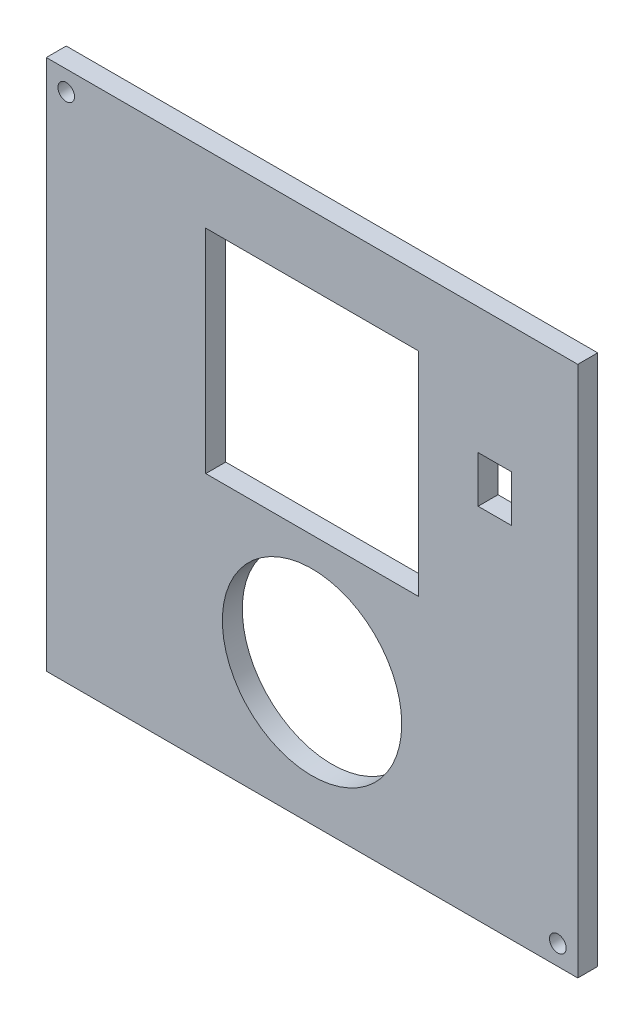
ISO-10303-21;
HEADER;
FILE_DESCRIPTION(('STEP AP214'),'2;1');
FILE_NAME('part.step','',(''),(''),'','','');
FILE_SCHEMA(('AUTOMOTIVE_DESIGN { 1 0 10303 214 1 1 1 1 }'));
ENDSEC;
DATA;
#1=APPLICATION_CONTEXT('core data for automotive mechanical design processes');
#2=APPLICATION_PROTOCOL_DEFINITION('international standard','automotive_design',2000,#1);
#3=PRODUCT_CONTEXT('',#1,'mechanical');
#4=PRODUCT('Part','Part','',(#3));
#5=PRODUCT_RELATED_PRODUCT_CATEGORY('part','',(#4));
#6=PRODUCT_DEFINITION_FORMATION('','',#4);
#7=PRODUCT_DEFINITION_CONTEXT('part definition',#1,'design');
#8=PRODUCT_DEFINITION('design','',#6,#7);
#9=PRODUCT_DEFINITION_SHAPE('','',#8);
#10=(LENGTH_UNIT() NAMED_UNIT(*) SI_UNIT(.MILLI.,.METRE.));
#11=(NAMED_UNIT(*) PLANE_ANGLE_UNIT() SI_UNIT($,.RADIAN.));
#12=(NAMED_UNIT(*) SI_UNIT($,.STERADIAN.) SOLID_ANGLE_UNIT());
#13=UNCERTAINTY_MEASURE_WITH_UNIT(LENGTH_MEASURE(1.E-05),#10,'distance_accuracy_value','');
#14=(GEOMETRIC_REPRESENTATION_CONTEXT(3) GLOBAL_UNCERTAINTY_ASSIGNED_CONTEXT((#13)) GLOBAL_UNIT_ASSIGNED_CONTEXT((#10,
#11,#12)) REPRESENTATION_CONTEXT('',''));
#15=CARTESIAN_POINT('',(0.,0.,0.));
#16=DIRECTION('',(0.,0.,1.));
#17=DIRECTION('',(1.,0.,0.));
#18=AXIS2_PLACEMENT_3D('',#15,#16,#17);
#19=CARTESIAN_POINT('',(0.,0.,3.));
#20=DIRECTION('',(1.,0.,0.));
#21=DIRECTION('',(0.,0.,-1.));
#22=AXIS2_PLACEMENT_3D('',#19,#20,#21);
#23=PLANE('',#22);
#24=DIRECTION('',(0.,-1.,0.));
#25=VECTOR('',#24,1.);
#26=CARTESIAN_POINT('',(0.,0.,0.));
#27=LINE('',#26,#25);
#28=CARTESIAN_POINT('',(0.,80.,0.));
#29=VERTEX_POINT('',#28);
#30=CARTESIAN_POINT('',(0.,0.,0.));
#31=VERTEX_POINT('',#30);
#32=EDGE_CURVE('E227',#29,#31,#27,.T.);
#33=ORIENTED_EDGE('',*,*,#32,.T.);
#34=DIRECTION('',(0.,0.,-1.));
#35=VECTOR('',#34,1.);
#36=CARTESIAN_POINT('',(0.,0.,3.));
#37=LINE('',#36,#35);
#38=CARTESIAN_POINT('',(0.,0.,3.));
#39=VERTEX_POINT('',#38);
#40=EDGE_CURVE('E268',#39,#31,#37,.T.);
#41=ORIENTED_EDGE('',*,*,#40,.F.);
#42=DIRECTION('',(0.,-1.,0.));
#43=VECTOR('',#42,1.);
#44=CARTESIAN_POINT('',(0.,0.,3.));
#45=LINE('',#44,#43);
#46=CARTESIAN_POINT('',(0.,80.,3.));
#47=VERTEX_POINT('',#46);
#48=EDGE_CURVE('E231',#47,#39,#45,.T.);
#49=ORIENTED_EDGE('',*,*,#48,.F.);
#50=DIRECTION('',(0.,0.,-1.));
#51=VECTOR('',#50,1.);
#52=CARTESIAN_POINT('',(0.,80.,3.));
#53=LINE('',#52,#51);
#54=EDGE_CURVE('E245',#47,#29,#53,.T.);
#55=ORIENTED_EDGE('',*,*,#54,.T.);
#56=EDGE_LOOP('',(#33,#41,#49,#55));
#57=FACE_BOUND('',#56,.T.);
#58=ADVANCED_FACE('F38',(#57),#23,.F.);
#59=CARTESIAN_POINT('',(0.,0.,3.));
#60=DIRECTION('',(0.,1.,0.));
#61=DIRECTION('',(0.,0.,1.));
#62=AXIS2_PLACEMENT_3D('',#59,#60,#61);
#63=PLANE('',#62);
#64=DIRECTION('',(1.,0.,0.));
#65=VECTOR('',#64,1.);
#66=CARTESIAN_POINT('',(0.,0.,0.));
#67=LINE('',#66,#65);
#68=CARTESIAN_POINT('',(80.,0.,0.));
#69=VERTEX_POINT('',#68);
#70=EDGE_CURVE('E249',#31,#69,#67,.T.);
#71=ORIENTED_EDGE('',*,*,#70,.T.);
#72=DIRECTION('',(0.,0.,-1.));
#73=VECTOR('',#72,1.);
#74=CARTESIAN_POINT('',(80.,0.,3.));
#75=LINE('',#74,#73);
#76=CARTESIAN_POINT('',(80.,0.,3.));
#77=VERTEX_POINT('',#76);
#78=EDGE_CURVE('E264',#77,#69,#75,.T.);
#79=ORIENTED_EDGE('',*,*,#78,.F.);
#80=DIRECTION('',(1.,0.,0.));
#81=VECTOR('',#80,1.);
#82=CARTESIAN_POINT('',(0.,0.,3.));
#83=LINE('',#82,#81);
#84=EDGE_CURVE('E235',#39,#77,#83,.T.);
#85=ORIENTED_EDGE('',*,*,#84,.F.);
#86=ORIENTED_EDGE('',*,*,#40,.T.);
#87=EDGE_LOOP('',(#71,#79,#85,#86));
#88=FACE_BOUND('',#87,.T.);
#89=ADVANCED_FACE('F298',(#88),#63,.F.);
#90=CARTESIAN_POINT('',(80.,0.,3.));
#91=DIRECTION('',(-1.,0.,0.));
#92=DIRECTION('',(0.,0.,1.));
#93=AXIS2_PLACEMENT_3D('',#90,#91,#92);
#94=PLANE('',#93);
#95=DIRECTION('',(0.,1.,0.));
#96=VECTOR('',#95,1.);
#97=CARTESIAN_POINT('',(80.,0.,0.));
#98=LINE('',#97,#96);
#99=CARTESIAN_POINT('',(80.,80.,0.));
#100=VERTEX_POINT('',#99);
#101=EDGE_CURVE('E252',#69,#100,#98,.T.);
#102=ORIENTED_EDGE('',*,*,#101,.T.);
#103=DIRECTION('',(0.,0.,-1.));
#104=VECTOR('',#103,1.);
#105=CARTESIAN_POINT('',(80.,80.,3.));
#106=LINE('',#105,#104);
#107=CARTESIAN_POINT('',(80.,80.,3.));
#108=VERTEX_POINT('',#107);
#109=EDGE_CURVE('E260',#108,#100,#106,.T.);
#110=ORIENTED_EDGE('',*,*,#109,.F.);
#111=DIRECTION('',(0.,1.,0.));
#112=VECTOR('',#111,1.);
#113=CARTESIAN_POINT('',(80.,0.,3.));
#114=LINE('',#113,#112);
#115=EDGE_CURVE('E239',#77,#108,#114,.T.);
#116=ORIENTED_EDGE('',*,*,#115,.F.);
#117=ORIENTED_EDGE('',*,*,#78,.T.);
#118=EDGE_LOOP('',(#102,#110,#116,#117));
#119=FACE_BOUND('',#118,.T.);
#120=ADVANCED_FACE('F303',(#119),#94,.F.);
#121=CARTESIAN_POINT('',(0.,80.,3.));
#122=DIRECTION('',(0.,-1.,0.));
#123=DIRECTION('',(0.,0.,-1.));
#124=AXIS2_PLACEMENT_3D('',#121,#122,#123);
#125=PLANE('',#124);
#126=DIRECTION('',(-1.,0.,0.));
#127=VECTOR('',#126,1.);
#128=CARTESIAN_POINT('',(0.,80.,0.));
#129=LINE('',#128,#127);
#130=EDGE_CURVE('E236',#100,#29,#129,.T.);
#131=ORIENTED_EDGE('',*,*,#130,.T.);
#132=ORIENTED_EDGE('',*,*,#54,.F.);
#133=DIRECTION('',(-1.,0.,0.));
#134=VECTOR('',#133,1.);
#135=CARTESIAN_POINT('',(0.,80.,3.));
#136=LINE('',#135,#134);
#137=EDGE_CURVE('E242',#108,#47,#136,.T.);
#138=ORIENTED_EDGE('',*,*,#137,.F.);
#139=ORIENTED_EDGE('',*,*,#109,.T.);
#140=EDGE_LOOP('',(#131,#132,#138,#139));
#141=FACE_BOUND('',#140,.T.);
#142=ADVANCED_FACE('F318',(#141),#125,.F.);
#143=CARTESIAN_POINT('',(0.,0.,3.));
#144=DIRECTION('',(0.,0.,-1.));
#145=DIRECTION('',(-1.,0.,0.));
#146=AXIS2_PLACEMENT_3D('',#143,#144,#145);
#147=PLANE('',#146);
#148=DIRECTION('',(-1.,0.,0.));
#149=VECTOR('',#148,1.);
#150=CARTESIAN_POINT('',(65.,61.,3.));
#151=LINE('',#150,#149);
#152=CARTESIAN_POINT('',(70.,61.,3.));
#153=VERTEX_POINT('',#152);
#154=CARTESIAN_POINT('',(65.,61.,3.));
#155=VERTEX_POINT('',#154);
#156=EDGE_CURVE('E139',#153,#155,#151,.T.);
#157=ORIENTED_EDGE('',*,*,#156,.F.);
#158=DIRECTION('',(0.,1.,0.));
#159=VECTOR('',#158,1.);
#160=CARTESIAN_POINT('',(70.,59.,3.));
#161=LINE('',#160,#159);
#162=CARTESIAN_POINT('',(70.,54.,3.));
#163=VERTEX_POINT('',#162);
#164=EDGE_CURVE('E53',#163,#153,#161,.T.);
#165=ORIENTED_EDGE('',*,*,#164,.F.);
#166=DIRECTION('',(1.,0.,0.));
#167=VECTOR('',#166,1.);
#168=CARTESIAN_POINT('',(70.,54.,3.));
#169=LINE('',#168,#167);
#170=CARTESIAN_POINT('',(65.,54.,3.));
#171=VERTEX_POINT('',#170);
#172=EDGE_CURVE('E147',#171,#163,#169,.T.);
#173=ORIENTED_EDGE('',*,*,#172,.F.);
#174=DIRECTION('',(0.,-1.,0.));
#175=VECTOR('',#174,1.);
#176=CARTESIAN_POINT('',(65.,59.,3.));
#177=LINE('',#176,#175);
#178=EDGE_CURVE('E129',#155,#171,#177,.T.);
#179=ORIENTED_EDGE('',*,*,#178,.F.);
#180=EDGE_LOOP('',(#157,#165,#173,#179));
#181=FACE_BOUND('',#180,.T.);
#182=CARTESIAN_POINT('',(40.,19.8527179635845,3.));
#183=DIRECTION('',(0.,0.,1.));
#184=DIRECTION('',(1.,0.,0.));
#185=AXIS2_PLACEMENT_3D('',#182,#183,#184);
#186=CIRCLE('',#185,13.5);
#187=CARTESIAN_POINT('',(53.5,19.8527179635845,3.));
#188=VERTEX_POINT('',#187);
#189=EDGE_CURVE('E158',#188,#188,#186,.T.);
#190=ORIENTED_EDGE('',*,*,#189,.F.);
#191=EDGE_LOOP('',(#190));
#192=FACE_BOUND('',#191,.T.);
#193=DIRECTION('',(0.,1.,0.));
#194=VECTOR('',#193,1.);
#195=CARTESIAN_POINT('',(56.,53.7576072097911,3.));
#196=LINE('',#195,#194);
#197=CARTESIAN_POINT('',(56.,37.7576072097911,3.));
#198=VERTEX_POINT('',#197);
#199=CARTESIAN_POINT('',(56.,69.7576072097911,3.));
#200=VERTEX_POINT('',#199);
#201=EDGE_CURVE('E167',#198,#200,#196,.T.);
#202=ORIENTED_EDGE('',*,*,#201,.F.);
#203=DIRECTION('',(1.,0.,0.));
#204=VECTOR('',#203,1.);
#205=CARTESIAN_POINT('',(40.,37.7576072097911,3.));
#206=LINE('',#205,#204);
#207=CARTESIAN_POINT('',(24.,37.7576072097911,3.));
#208=VERTEX_POINT('',#207);
#209=EDGE_CURVE('E176',#208,#198,#206,.T.);
#210=ORIENTED_EDGE('',*,*,#209,.F.);
#211=DIRECTION('',(0.,-1.,0.));
#212=VECTOR('',#211,1.);
#213=CARTESIAN_POINT('',(24.,37.7576072097911,3.));
#214=LINE('',#213,#212);
#215=CARTESIAN_POINT('',(24.,69.7576072097911,3.));
#216=VERTEX_POINT('',#215);
#217=EDGE_CURVE('E196',#216,#208,#214,.T.);
#218=ORIENTED_EDGE('',*,*,#217,.F.);
#219=DIRECTION('',(-1.,0.,0.));
#220=VECTOR('',#219,1.);
#221=CARTESIAN_POINT('',(24.,69.7576072097911,3.));
#222=LINE('',#221,#220);
#223=EDGE_CURVE('E192',#200,#216,#222,.T.);
#224=ORIENTED_EDGE('',*,*,#223,.F.);
#225=EDGE_LOOP('',(#202,#210,#218,#224));
#226=FACE_BOUND('',#225,.T.);
#227=CARTESIAN_POINT('',(77.,3.,3.));
#228=DIRECTION('',(0.,0.,1.));
#229=DIRECTION('',(1.,0.,0.));
#230=AXIS2_PLACEMENT_3D('',#227,#228,#229);
#231=CIRCLE('',#230,1.25);
#232=CARTESIAN_POINT('',(78.25,3.,3.));
#233=VERTEX_POINT('',#232);
#234=EDGE_CURVE('E206',#233,#233,#231,.T.);
#235=ORIENTED_EDGE('',*,*,#234,.F.);
#236=EDGE_LOOP('',(#235));
#237=FACE_BOUND('',#236,.T.);
#238=CARTESIAN_POINT('',(3.,77.,3.));
#239=DIRECTION('',(0.,0.,1.));
#240=DIRECTION('',(1.,0.,0.));
#241=AXIS2_PLACEMENT_3D('',#238,#239,#240);
#242=CIRCLE('',#241,1.25);
#243=CARTESIAN_POINT('',(4.25,77.,3.));
#244=VERTEX_POINT('',#243);
#245=EDGE_CURVE('E219',#244,#244,#242,.T.);
#246=ORIENTED_EDGE('',*,*,#245,.F.);
#247=EDGE_LOOP('',(#246));
#248=FACE_BOUND('',#247,.T.);
#249=ORIENTED_EDGE('',*,*,#48,.T.);
#250=ORIENTED_EDGE('',*,*,#84,.T.);
#251=ORIENTED_EDGE('',*,*,#115,.T.);
#252=ORIENTED_EDGE('',*,*,#137,.T.);
#253=EDGE_LOOP('',(#249,#250,#251,#252));
#254=FACE_BOUND('',#253,.T.);
#255=ADVANCED_FACE('F144',(#181,#192,#226,#237,#248,#254),#147,.F.);
#256=CARTESIAN_POINT('',(0.,0.,0.));
#257=DIRECTION('',(0.,0.,-1.));
#258=DIRECTION('',(-1.,0.,0.));
#259=AXIS2_PLACEMENT_3D('',#256,#257,#258);
#260=PLANE('',#259);
#261=DIRECTION('',(0.,-1.,0.));
#262=VECTOR('',#261,1.);
#263=CARTESIAN_POINT('',(70.,0.,0.));
#264=LINE('',#263,#262);
#265=CARTESIAN_POINT('',(70.,61.,0.));
#266=VERTEX_POINT('',#265);
#267=CARTESIAN_POINT('',(70.,54.,0.));
#268=VERTEX_POINT('',#267);
#269=EDGE_CURVE('E11',#266,#268,#264,.T.);
#270=ORIENTED_EDGE('',*,*,#269,.F.);
#271=DIRECTION('',(1.,0.,0.));
#272=VECTOR('',#271,1.);
#273=CARTESIAN_POINT('',(0.,61.,0.));
#274=LINE('',#273,#272);
#275=CARTESIAN_POINT('',(65.,61.,0.));
#276=VERTEX_POINT('',#275);
#277=EDGE_CURVE('E272',#276,#266,#274,.T.);
#278=ORIENTED_EDGE('',*,*,#277,.F.);
#279=DIRECTION('',(0.,1.,0.));
#280=VECTOR('',#279,1.);
#281=CARTESIAN_POINT('',(65.,0.,0.));
#282=LINE('',#281,#280);
#283=CARTESIAN_POINT('',(65.,54.,0.));
#284=VERTEX_POINT('',#283);
#285=EDGE_CURVE('E132',#284,#276,#282,.T.);
#286=ORIENTED_EDGE('',*,*,#285,.F.);
#287=DIRECTION('',(-1.,0.,0.));
#288=VECTOR('',#287,1.);
#289=CARTESIAN_POINT('',(0.,54.,0.));
#290=LINE('',#289,#288);
#291=EDGE_CURVE('E46',#268,#284,#290,.T.);
#292=ORIENTED_EDGE('',*,*,#291,.F.);
#293=EDGE_LOOP('',(#270,#278,#286,#292));
#294=FACE_BOUND('',#293,.T.);
#295=CARTESIAN_POINT('',(40.,19.8527179635845,0.));
#296=DIRECTION('',(0.,0.,1.));
#297=DIRECTION('',(1.,0.,0.));
#298=AXIS2_PLACEMENT_3D('',#295,#296,#297);
#299=CIRCLE('',#298,13.5);
#300=CARTESIAN_POINT('',(53.5,19.8527179635845,0.));
#301=VERTEX_POINT('',#300);
#302=EDGE_CURVE('E163',#301,#301,#299,.T.);
#303=ORIENTED_EDGE('',*,*,#302,.T.);
#304=EDGE_LOOP('',(#303));
#305=FACE_BOUND('',#304,.T.);
#306=DIRECTION('',(1.,0.,0.));
#307=VECTOR('',#306,1.);
#308=CARTESIAN_POINT('',(24.,37.7576072097911,0.));
#309=LINE('',#308,#307);
#310=CARTESIAN_POINT('',(24.,37.7576072097911,0.));
#311=VERTEX_POINT('',#310);
#312=CARTESIAN_POINT('',(56.,37.7576072097911,0.));
#313=VERTEX_POINT('',#312);
#314=EDGE_CURVE('E184',#311,#313,#309,.T.);
#315=ORIENTED_EDGE('',*,*,#314,.T.);
#316=DIRECTION('',(0.,1.,0.));
#317=VECTOR('',#316,1.);
#318=CARTESIAN_POINT('',(56.,53.7576072097911,0.));
#319=LINE('',#318,#317);
#320=CARTESIAN_POINT('',(56.,69.7576072097911,0.));
#321=VERTEX_POINT('',#320);
#322=EDGE_CURVE('E171',#313,#321,#319,.T.);
#323=ORIENTED_EDGE('',*,*,#322,.T.);
#324=DIRECTION('',(-1.,0.,0.));
#325=VECTOR('',#324,1.);
#326=CARTESIAN_POINT('',(40.,69.7576072097911,0.));
#327=LINE('',#326,#325);
#328=CARTESIAN_POINT('',(24.,69.7576072097911,0.));
#329=VERTEX_POINT('',#328);
#330=EDGE_CURVE('E175',#321,#329,#327,.T.);
#331=ORIENTED_EDGE('',*,*,#330,.T.);
#332=DIRECTION('',(0.,-1.,0.));
#333=VECTOR('',#332,1.);
#334=CARTESIAN_POINT('',(24.,37.7576072097911,0.));
#335=LINE('',#334,#333);
#336=EDGE_CURVE('E180',#329,#311,#335,.T.);
#337=ORIENTED_EDGE('',*,*,#336,.T.);
#338=EDGE_LOOP('',(#315,#323,#331,#337));
#339=FACE_BOUND('',#338,.T.);
#340=CARTESIAN_POINT('',(77.,3.,0.));
#341=DIRECTION('',(0.,0.,1.));
#342=DIRECTION('',(1.,0.,0.));
#343=AXIS2_PLACEMENT_3D('',#340,#341,#342);
#344=CIRCLE('',#343,1.25);
#345=CARTESIAN_POINT('',(78.25,3.,0.));
#346=VERTEX_POINT('',#345);
#347=EDGE_CURVE('E215',#346,#346,#344,.T.);
#348=ORIENTED_EDGE('',*,*,#347,.T.);
#349=EDGE_LOOP('',(#348));
#350=FACE_BOUND('',#349,.T.);
#351=CARTESIAN_POINT('',(3.,77.,0.));
#352=DIRECTION('',(0.,0.,1.));
#353=DIRECTION('',(1.,0.,0.));
#354=AXIS2_PLACEMENT_3D('',#351,#352,#353);
#355=CIRCLE('',#354,1.25);
#356=CARTESIAN_POINT('',(4.25,77.,0.));
#357=VERTEX_POINT('',#356);
#358=EDGE_CURVE('E223',#357,#357,#355,.T.);
#359=ORIENTED_EDGE('',*,*,#358,.T.);
#360=EDGE_LOOP('',(#359));
#361=FACE_BOUND('',#360,.T.);
#362=ORIENTED_EDGE('',*,*,#32,.F.);
#363=ORIENTED_EDGE('',*,*,#130,.F.);
#364=ORIENTED_EDGE('',*,*,#101,.F.);
#365=ORIENTED_EDGE('',*,*,#70,.F.);
#366=EDGE_LOOP('',(#362,#363,#364,#365));
#367=FACE_BOUND('',#366,.T.);
#368=ADVANCED_FACE('F283',(#294,#305,#339,#350,#361,#367),#260,.T.);
#369=CARTESIAN_POINT('',(3.,77.,0.));
#370=DIRECTION('',(0.,0.,1.));
#371=DIRECTION('',(1.,0.,0.));
#372=AXIS2_PLACEMENT_3D('',#369,#370,#371);
#373=CYLINDRICAL_SURFACE('',#372,1.25);
#374=ORIENTED_EDGE('',*,*,#358,.F.);
#375=EDGE_LOOP('',(#374));
#376=FACE_BOUND('',#375,.T.);
#377=ORIENTED_EDGE('',*,*,#245,.T.);
#378=EDGE_LOOP('',(#377));
#379=FACE_BOUND('',#378,.T.);
#380=ADVANCED_FACE('F329',(#376,#379),#373,.F.);
#381=CARTESIAN_POINT('',(77.,3.,0.));
#382=DIRECTION('',(0.,0.,1.));
#383=DIRECTION('',(1.,0.,0.));
#384=AXIS2_PLACEMENT_3D('',#381,#382,#383);
#385=CYLINDRICAL_SURFACE('',#384,1.25);
#386=ORIENTED_EDGE('',*,*,#347,.F.);
#387=EDGE_LOOP('',(#386));
#388=FACE_BOUND('',#387,.T.);
#389=ORIENTED_EDGE('',*,*,#234,.T.);
#390=EDGE_LOOP('',(#389));
#391=FACE_BOUND('',#390,.T.);
#392=ADVANCED_FACE('F334',(#388,#391),#385,.F.);
#393=CARTESIAN_POINT('',(40.,37.7576072097911,0.));
#394=DIRECTION('',(0.,-1.,0.));
#395=DIRECTION('',(0.,0.,-1.));
#396=AXIS2_PLACEMENT_3D('',#393,#394,#395);
#397=PLANE('',#396);
#398=ORIENTED_EDGE('',*,*,#209,.T.);
#399=DIRECTION('',(0.,0.,1.));
#400=VECTOR('',#399,1.);
#401=CARTESIAN_POINT('',(56.,37.7576072097911,0.));
#402=LINE('',#401,#400);
#403=EDGE_CURVE('E202',#313,#198,#402,.T.);
#404=ORIENTED_EDGE('',*,*,#403,.F.);
#405=ORIENTED_EDGE('',*,*,#314,.F.);
#406=DIRECTION('',(0.,0.,1.));
#407=VECTOR('',#406,1.);
#408=CARTESIAN_POINT('',(24.,37.7576072097911,0.));
#409=LINE('',#408,#407);
#410=EDGE_CURVE('E207',#311,#208,#409,.T.);
#411=ORIENTED_EDGE('',*,*,#410,.T.);
#412=EDGE_LOOP('',(#398,#404,#405,#411));
#413=FACE_BOUND('',#412,.T.);
#414=ADVANCED_FACE('F338',(#413),#397,.F.);
#415=CARTESIAN_POINT('',(24.,37.7576072097911,0.));
#416=DIRECTION('',(-1.,0.,0.));
#417=DIRECTION('',(0.,0.,1.));
#418=AXIS2_PLACEMENT_3D('',#415,#416,#417);
#419=PLANE('',#418);
#420=ORIENTED_EDGE('',*,*,#217,.T.);
#421=ORIENTED_EDGE('',*,*,#410,.F.);
#422=ORIENTED_EDGE('',*,*,#336,.F.);
#423=DIRECTION('',(0.,0.,1.));
#424=VECTOR('',#423,1.);
#425=CARTESIAN_POINT('',(24.,69.7576072097911,0.));
#426=LINE('',#425,#424);
#427=EDGE_CURVE('E210',#329,#216,#426,.T.);
#428=ORIENTED_EDGE('',*,*,#427,.T.);
#429=EDGE_LOOP('',(#420,#421,#422,#428));
#430=FACE_BOUND('',#429,.T.);
#431=ADVANCED_FACE('F346',(#430),#419,.F.);
#432=CARTESIAN_POINT('',(24.,69.7576072097911,0.));
#433=DIRECTION('',(0.,1.,0.));
#434=DIRECTION('',(0.,0.,1.));
#435=AXIS2_PLACEMENT_3D('',#432,#433,#434);
#436=PLANE('',#435);
#437=ORIENTED_EDGE('',*,*,#223,.T.);
#438=ORIENTED_EDGE('',*,*,#427,.F.);
#439=ORIENTED_EDGE('',*,*,#330,.F.);
#440=DIRECTION('',(0.,0.,1.));
#441=VECTOR('',#440,1.);
#442=CARTESIAN_POINT('',(56.,69.7576072097911,0.));
#443=LINE('',#442,#441);
#444=EDGE_CURVE('E188',#321,#200,#443,.T.);
#445=ORIENTED_EDGE('',*,*,#444,.T.);
#446=EDGE_LOOP('',(#437,#438,#439,#445));
#447=FACE_BOUND('',#446,.T.);
#448=ADVANCED_FACE('F342',(#447),#436,.F.);
#449=CARTESIAN_POINT('',(56.,53.7576072097911,0.));
#450=DIRECTION('',(1.,0.,0.));
#451=DIRECTION('',(0.,0.,-1.));
#452=AXIS2_PLACEMENT_3D('',#449,#450,#451);
#453=PLANE('',#452);
#454=ORIENTED_EDGE('',*,*,#201,.T.);
#455=ORIENTED_EDGE('',*,*,#444,.F.);
#456=ORIENTED_EDGE('',*,*,#322,.F.);
#457=ORIENTED_EDGE('',*,*,#403,.T.);
#458=EDGE_LOOP('',(#454,#455,#456,#457));
#459=FACE_BOUND('',#458,.T.);
#460=ADVANCED_FACE('F294',(#459),#453,.F.);
#461=CARTESIAN_POINT('',(40.,19.8527179635845,0.));
#462=DIRECTION('',(0.,0.,1.));
#463=DIRECTION('',(1.,0.,0.));
#464=AXIS2_PLACEMENT_3D('',#461,#462,#463);
#465=CYLINDRICAL_SURFACE('',#464,13.5);
#466=ORIENTED_EDGE('',*,*,#302,.F.);
#467=EDGE_LOOP('',(#466));
#468=FACE_BOUND('',#467,.T.);
#469=ORIENTED_EDGE('',*,*,#189,.T.);
#470=EDGE_LOOP('',(#469));
#471=FACE_BOUND('',#470,.T.);
#472=ADVANCED_FACE('F287',(#468,#471),#465,.F.);
#473=CARTESIAN_POINT('',(70.,59.,-21.));
#474=DIRECTION('',(1.,0.,0.));
#475=DIRECTION('',(0.,0.,-1.));
#476=AXIS2_PLACEMENT_3D('',#473,#474,#475);
#477=PLANE('',#476);
#478=ORIENTED_EDGE('',*,*,#269,.T.);
#479=DIRECTION('',(0.,0.,1.));
#480=VECTOR('',#479,1.);
#481=CARTESIAN_POINT('',(70.,54.,-21.));
#482=LINE('',#481,#480);
#483=EDGE_CURVE('E155',#268,#163,#482,.T.);
#484=ORIENTED_EDGE('',*,*,#483,.T.);
#485=ORIENTED_EDGE('',*,*,#164,.T.);
#486=DIRECTION('',(0.,0.,1.));
#487=VECTOR('',#486,1.);
#488=CARTESIAN_POINT('',(70.,61.,-21.));
#489=LINE('',#488,#487);
#490=EDGE_CURVE('E136',#266,#153,#489,.T.);
#491=ORIENTED_EDGE('',*,*,#490,.F.);
#492=EDGE_LOOP('',(#478,#484,#485,#491));
#493=FACE_BOUND('',#492,.T.);
#494=ADVANCED_FACE('F285',(#493),#477,.F.);
#495=CARTESIAN_POINT('',(70.,54.,-21.));
#496=DIRECTION('',(0.,-1.,0.));
#497=DIRECTION('',(0.,0.,-1.));
#498=AXIS2_PLACEMENT_3D('',#495,#496,#497);
#499=PLANE('',#498);
#500=ORIENTED_EDGE('',*,*,#291,.T.);
#501=DIRECTION('',(0.,0.,1.));
#502=VECTOR('',#501,1.);
#503=CARTESIAN_POINT('',(65.,54.,-21.));
#504=LINE('',#503,#502);
#505=EDGE_CURVE('E135',#284,#171,#504,.T.);
#506=ORIENTED_EDGE('',*,*,#505,.T.);
#507=ORIENTED_EDGE('',*,*,#172,.T.);
#508=ORIENTED_EDGE('',*,*,#483,.F.);
#509=EDGE_LOOP('',(#500,#506,#507,#508));
#510=FACE_BOUND('',#509,.T.);
#511=ADVANCED_FACE('F280',(#510),#499,.F.);
#512=CARTESIAN_POINT('',(65.,59.,-21.));
#513=DIRECTION('',(-1.,0.,0.));
#514=DIRECTION('',(0.,0.,1.));
#515=AXIS2_PLACEMENT_3D('',#512,#513,#514);
#516=PLANE('',#515);
#517=ORIENTED_EDGE('',*,*,#285,.T.);
#518=DIRECTION('',(0.,0.,1.));
#519=VECTOR('',#518,1.);
#520=CARTESIAN_POINT('',(65.,61.,-21.));
#521=LINE('',#520,#519);
#522=EDGE_CURVE('E61',#276,#155,#521,.T.);
#523=ORIENTED_EDGE('',*,*,#522,.T.);
#524=ORIENTED_EDGE('',*,*,#178,.T.);
#525=ORIENTED_EDGE('',*,*,#505,.F.);
#526=EDGE_LOOP('',(#517,#523,#524,#525));
#527=FACE_BOUND('',#526,.T.);
#528=ADVANCED_FACE('F126',(#527),#516,.F.);
#529=CARTESIAN_POINT('',(65.,61.,-21.));
#530=DIRECTION('',(0.,1.,0.));
#531=DIRECTION('',(0.,0.,1.));
#532=AXIS2_PLACEMENT_3D('',#529,#530,#531);
#533=PLANE('',#532);
#534=ORIENTED_EDGE('',*,*,#277,.T.);
#535=ORIENTED_EDGE('',*,*,#490,.T.);
#536=ORIENTED_EDGE('',*,*,#156,.T.);
#537=ORIENTED_EDGE('',*,*,#522,.F.);
#538=EDGE_LOOP('',(#534,#535,#536,#537));
#539=FACE_BOUND('',#538,.T.);
#540=ADVANCED_FACE('F140',(#539),#533,.F.);
#541=CLOSED_SHELL('',(#58,#89,#120,#142,#255,#368,#380,#392,#414,#431,#448,#460,#472,#494,#511,
#528,#540));
#542=MANIFOLD_SOLID_BREP('B2',#541);
#543=ADVANCED_BREP_SHAPE_REPRESENTATION('',(#18,#542),#14);
#544=SHAPE_DEFINITION_REPRESENTATION(#9,#543);
ENDSEC;
END-ISO-10303-21;
